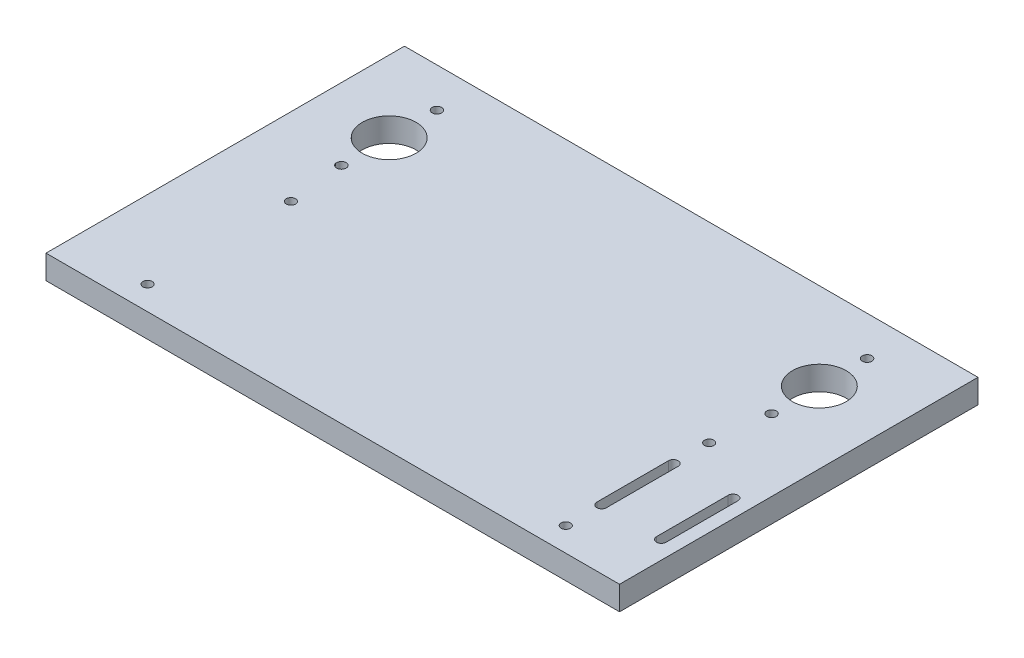
ISO-10303-21;
HEADER;
FILE_DESCRIPTION(('STEP AP214'),'2;1');
FILE_NAME('part.step','',(''),(''),'','','');
FILE_SCHEMA(('AUTOMOTIVE_DESIGN { 1 0 10303 214 1 1 1 1 }'));
ENDSEC;
DATA;
#1=APPLICATION_CONTEXT('core data for automotive mechanical design processes');
#2=APPLICATION_PROTOCOL_DEFINITION('international standard','automotive_design',2000,#1);
#3=PRODUCT_CONTEXT('',#1,'mechanical');
#4=PRODUCT('Part','Part','',(#3));
#5=PRODUCT_RELATED_PRODUCT_CATEGORY('part','',(#4));
#6=PRODUCT_DEFINITION_FORMATION('','',#4);
#7=PRODUCT_DEFINITION_CONTEXT('part definition',#1,'design');
#8=PRODUCT_DEFINITION('design','',#6,#7);
#9=PRODUCT_DEFINITION_SHAPE('','',#8);
#10=(LENGTH_UNIT() NAMED_UNIT(*) SI_UNIT(.MILLI.,.METRE.));
#11=(NAMED_UNIT(*) PLANE_ANGLE_UNIT() SI_UNIT($,.RADIAN.));
#12=(NAMED_UNIT(*) SI_UNIT($,.STERADIAN.) SOLID_ANGLE_UNIT());
#13=UNCERTAINTY_MEASURE_WITH_UNIT(LENGTH_MEASURE(1.E-05),#10,'distance_accuracy_value','');
#14=(GEOMETRIC_REPRESENTATION_CONTEXT(3) GLOBAL_UNCERTAINTY_ASSIGNED_CONTEXT((#13)) GLOBAL_UNIT_ASSIGNED_CONTEXT((#10,
#11,#12)) REPRESENTATION_CONTEXT('',''));
#15=CARTESIAN_POINT('',(0.,0.,0.));
#16=DIRECTION('',(0.,0.,1.));
#17=DIRECTION('',(1.,0.,0.));
#18=AXIS2_PLACEMENT_3D('',#15,#16,#17);
#19=CARTESIAN_POINT('',(-152.4,12.7,0.));
#20=DIRECTION('',(1.,0.,0.));
#21=DIRECTION('',(0.,0.,-1.));
#22=AXIS2_PLACEMENT_3D('',#19,#20,#21);
#23=PLANE('',#22);
#24=DIRECTION('',(0.,0.,1.));
#25=VECTOR('',#24,1.);
#26=CARTESIAN_POINT('',(-152.4,0.,0.));
#27=LINE('',#26,#25);
#28=CARTESIAN_POINT('',(-152.4,0.,-133.35));
#29=VERTEX_POINT('',#28);
#30=CARTESIAN_POINT('',(-152.4,0.,57.15));
#31=VERTEX_POINT('',#30);
#32=EDGE_CURVE('E243',#29,#31,#27,.T.);
#33=ORIENTED_EDGE('',*,*,#32,.T.);
#34=DIRECTION('',(0.,-1.,0.));
#35=VECTOR('',#34,1.);
#36=CARTESIAN_POINT('',(-152.4,12.7,57.15));
#37=LINE('',#36,#35);
#38=CARTESIAN_POINT('',(-152.4,12.7,57.15));
#39=VERTEX_POINT('',#38);
#40=EDGE_CURVE('E11',#39,#31,#37,.T.);
#41=ORIENTED_EDGE('',*,*,#40,.F.);
#42=DIRECTION('',(0.,0.,1.));
#43=VECTOR('',#42,1.);
#44=CARTESIAN_POINT('',(-152.4,12.7,0.));
#45=LINE('',#44,#43);
#46=CARTESIAN_POINT('',(-152.4,12.7,-133.35));
#47=VERTEX_POINT('',#46);
#48=EDGE_CURVE('E214',#47,#39,#45,.T.);
#49=ORIENTED_EDGE('',*,*,#48,.F.);
#50=DIRECTION('',(0.,-1.,0.));
#51=VECTOR('',#50,1.);
#52=CARTESIAN_POINT('',(-152.4,12.7,-133.35));
#53=LINE('',#52,#51);
#54=EDGE_CURVE('E228',#47,#29,#53,.T.);
#55=ORIENTED_EDGE('',*,*,#54,.T.);
#56=EDGE_LOOP('',(#33,#41,#49,#55));
#57=FACE_BOUND('',#56,.T.);
#58=ADVANCED_FACE('F35',(#57),#23,.F.);
#59=CARTESIAN_POINT('',(0.,12.7,57.15));
#60=DIRECTION('',(0.,0.,-1.));
#61=DIRECTION('',(-1.,0.,0.));
#62=AXIS2_PLACEMENT_3D('',#59,#60,#61);
#63=PLANE('',#62);
#64=DIRECTION('',(1.,0.,0.));
#65=VECTOR('',#64,1.);
#66=CARTESIAN_POINT('',(0.,0.,57.15));
#67=LINE('',#66,#65);
#68=CARTESIAN_POINT('',(152.4,0.,57.15));
#69=VERTEX_POINT('',#68);
#70=EDGE_CURVE('E246',#31,#69,#67,.T.);
#71=ORIENTED_EDGE('',*,*,#70,.T.);
#72=DIRECTION('',(0.,-1.,0.));
#73=VECTOR('',#72,1.);
#74=CARTESIAN_POINT('',(152.4,12.7,57.15));
#75=LINE('',#74,#73);
#76=CARTESIAN_POINT('',(152.4,12.7,57.15));
#77=VERTEX_POINT('',#76);
#78=EDGE_CURVE('E43',#77,#69,#75,.T.);
#79=ORIENTED_EDGE('',*,*,#78,.F.);
#80=DIRECTION('',(1.,0.,0.));
#81=VECTOR('',#80,1.);
#82=CARTESIAN_POINT('',(0.,12.7,57.15));
#83=LINE('',#82,#81);
#84=EDGE_CURVE('E217',#39,#77,#83,.T.);
#85=ORIENTED_EDGE('',*,*,#84,.F.);
#86=ORIENTED_EDGE('',*,*,#40,.T.);
#87=EDGE_LOOP('',(#71,#79,#85,#86));
#88=FACE_BOUND('',#87,.T.);
#89=ADVANCED_FACE('F265',(#88),#63,.F.);
#90=CARTESIAN_POINT('',(152.4,12.7,0.));
#91=DIRECTION('',(1.,0.,0.));
#92=DIRECTION('',(0.,0.,-1.));
#93=AXIS2_PLACEMENT_3D('',#90,#91,#92);
#94=PLANE('',#93);
#95=DIRECTION('',(0.,0.,1.));
#96=VECTOR('',#95,1.);
#97=CARTESIAN_POINT('',(152.4,0.,0.));
#98=LINE('',#97,#96);
#99=CARTESIAN_POINT('',(152.4,0.,-133.35));
#100=VERTEX_POINT('',#99);
#101=EDGE_CURVE('E249',#100,#69,#98,.T.);
#102=ORIENTED_EDGE('',*,*,#101,.F.);
#103=DIRECTION('',(0.,-1.,0.));
#104=VECTOR('',#103,1.);
#105=CARTESIAN_POINT('',(152.4,12.7,-133.35));
#106=LINE('',#105,#104);
#107=CARTESIAN_POINT('',(152.4,12.7,-133.35));
#108=VERTEX_POINT('',#107);
#109=EDGE_CURVE('E258',#108,#100,#106,.T.);
#110=ORIENTED_EDGE('',*,*,#109,.F.);
#111=DIRECTION('',(0.,0.,1.));
#112=VECTOR('',#111,1.);
#113=CARTESIAN_POINT('',(152.4,12.7,0.));
#114=LINE('',#113,#112);
#115=EDGE_CURVE('E219',#108,#77,#114,.T.);
#116=ORIENTED_EDGE('',*,*,#115,.T.);
#117=ORIENTED_EDGE('',*,*,#78,.T.);
#118=EDGE_LOOP('',(#102,#110,#116,#117));
#119=FACE_BOUND('',#118,.T.);
#120=ADVANCED_FACE('F262',(#119),#94,.T.);
#121=CARTESIAN_POINT('',(0.,12.7,-133.35));
#122=DIRECTION('',(0.,0.,-1.));
#123=DIRECTION('',(-1.,0.,0.));
#124=AXIS2_PLACEMENT_3D('',#121,#122,#123);
#125=PLANE('',#124);
#126=DIRECTION('',(1.,0.,0.));
#127=VECTOR('',#126,1.);
#128=CARTESIAN_POINT('',(0.,0.,-133.35));
#129=LINE('',#128,#127);
#130=EDGE_CURVE('E252',#29,#100,#129,.T.);
#131=ORIENTED_EDGE('',*,*,#130,.F.);
#132=ORIENTED_EDGE('',*,*,#54,.F.);
#133=DIRECTION('',(1.,0.,0.));
#134=VECTOR('',#133,1.);
#135=CARTESIAN_POINT('',(0.,12.7,-133.35));
#136=LINE('',#135,#134);
#137=EDGE_CURVE('E222',#47,#108,#136,.T.);
#138=ORIENTED_EDGE('',*,*,#137,.T.);
#139=ORIENTED_EDGE('',*,*,#109,.T.);
#140=EDGE_LOOP('',(#131,#132,#138,#139));
#141=FACE_BOUND('',#140,.T.);
#142=ADVANCED_FACE('F272',(#141),#125,.T.);
#143=CARTESIAN_POINT('',(-114.3,12.7,-87.122));
#144=DIRECTION('',(0.,-1.,0.));
#145=DIRECTION('',(0.,0.,-1.));
#146=AXIS2_PLACEMENT_3D('',#143,#144,#145);
#147=CYLINDRICAL_SURFACE('',#146,14.2748);
#148=CARTESIAN_POINT('',(-114.3,12.7,-87.122));
#149=DIRECTION('',(0.,1.,0.));
#150=DIRECTION('',(0.,0.,1.));
#151=AXIS2_PLACEMENT_3D('',#148,#149,#150);
#152=CIRCLE('',#151,14.2748);
#153=CARTESIAN_POINT('',(-114.3,12.7,-72.8472));
#154=VERTEX_POINT('',#153);
#155=EDGE_CURVE('E211',#154,#154,#152,.T.);
#156=ORIENTED_EDGE('',*,*,#155,.T.);
#157=EDGE_LOOP('',(#156));
#158=FACE_BOUND('',#157,.T.);
#159=CARTESIAN_POINT('',(-114.3,0.,-87.122));
#160=DIRECTION('',(0.,1.,0.));
#161=DIRECTION('',(0.,0.,1.));
#162=AXIS2_PLACEMENT_3D('',#159,#160,#161);
#163=CIRCLE('',#162,14.2748);
#164=CARTESIAN_POINT('',(-114.3,0.,-72.8472));
#165=VERTEX_POINT('',#164);
#166=EDGE_CURVE('E240',#165,#165,#163,.T.);
#167=ORIENTED_EDGE('',*,*,#166,.F.);
#168=EDGE_LOOP('',(#167));
#169=FACE_BOUND('',#168,.T.);
#170=ADVANCED_FACE('F287',(#158,#169),#147,.F.);
#171=CARTESIAN_POINT('',(114.3,12.7,-87.122));
#172=DIRECTION('',(0.,-1.,0.));
#173=DIRECTION('',(0.,0.,-1.));
#174=AXIS2_PLACEMENT_3D('',#171,#172,#173);
#175=CYLINDRICAL_SURFACE('',#174,14.2748);
#176=CARTESIAN_POINT('',(114.3,12.7,-87.122));
#177=DIRECTION('',(0.,1.,0.));
#178=DIRECTION('',(0.,0.,1.));
#179=AXIS2_PLACEMENT_3D('',#176,#177,#178);
#180=CIRCLE('',#179,14.2748);
#181=CARTESIAN_POINT('',(114.3,12.7,-72.8472));
#182=VERTEX_POINT('',#181);
#183=EDGE_CURVE('E208',#182,#182,#180,.T.);
#184=ORIENTED_EDGE('',*,*,#183,.T.);
#185=EDGE_LOOP('',(#184));
#186=FACE_BOUND('',#185,.T.);
#187=CARTESIAN_POINT('',(114.3,0.,-87.122));
#188=DIRECTION('',(0.,1.,0.));
#189=DIRECTION('',(0.,0.,1.));
#190=AXIS2_PLACEMENT_3D('',#187,#188,#189);
#191=CIRCLE('',#190,14.2748);
#192=CARTESIAN_POINT('',(114.3,0.,-72.8472));
#193=VERTEX_POINT('',#192);
#194=EDGE_CURVE('E237',#193,#193,#191,.T.);
#195=ORIENTED_EDGE('',*,*,#194,.F.);
#196=EDGE_LOOP('',(#195));
#197=FACE_BOUND('',#196,.T.);
#198=ADVANCED_FACE('F290',(#186,#197),#175,.F.);
#199=CARTESIAN_POINT('',(-114.3,12.7,-112.522));
#200=DIRECTION('',(0.,-1.,0.));
#201=DIRECTION('',(0.,0.,-1.));
#202=AXIS2_PLACEMENT_3D('',#199,#200,#201);
#203=CYLINDRICAL_SURFACE('',#202,2.53999999999999);
#204=CARTESIAN_POINT('',(-114.3,12.7,-112.522));
#205=DIRECTION('',(0.,1.,0.));
#206=DIRECTION('',(0.,0.,1.));
#207=AXIS2_PLACEMENT_3D('',#204,#205,#206);
#208=CIRCLE('',#207,2.53999999999999);
#209=CARTESIAN_POINT('',(-114.3,12.7,-109.982));
#210=VERTEX_POINT('',#209);
#211=EDGE_CURVE('E205',#210,#210,#208,.T.);
#212=ORIENTED_EDGE('',*,*,#211,.T.);
#213=EDGE_LOOP('',(#212));
#214=FACE_BOUND('',#213,.T.);
#215=CARTESIAN_POINT('',(-114.3,0.,-112.522));
#216=DIRECTION('',(0.,1.,0.));
#217=DIRECTION('',(0.,0.,1.));
#218=AXIS2_PLACEMENT_3D('',#215,#216,#217);
#219=CIRCLE('',#218,2.53999999999999);
#220=CARTESIAN_POINT('',(-114.3,0.,-109.982));
#221=VERTEX_POINT('',#220);
#222=EDGE_CURVE('E234',#221,#221,#219,.T.);
#223=ORIENTED_EDGE('',*,*,#222,.F.);
#224=EDGE_LOOP('',(#223));
#225=FACE_BOUND('',#224,.T.);
#226=ADVANCED_FACE('F294',(#214,#225),#203,.F.);
#227=CARTESIAN_POINT('',(-114.3,12.7,-61.7219999999999));
#228=DIRECTION('',(0.,-1.,0.));
#229=DIRECTION('',(0.,0.,-1.));
#230=AXIS2_PLACEMENT_3D('',#227,#228,#229);
#231=CYLINDRICAL_SURFACE('',#230,2.54);
#232=CARTESIAN_POINT('',(-114.3,12.7,-61.7219999999999));
#233=DIRECTION('',(0.,1.,0.));
#234=DIRECTION('',(0.,0.,1.));
#235=AXIS2_PLACEMENT_3D('',#232,#233,#234);
#236=CIRCLE('',#235,2.54);
#237=CARTESIAN_POINT('',(-114.3,12.7,-59.182));
#238=VERTEX_POINT('',#237);
#239=EDGE_CURVE('E201',#238,#238,#236,.T.);
#240=ORIENTED_EDGE('',*,*,#239,.T.);
#241=EDGE_LOOP('',(#240));
#242=FACE_BOUND('',#241,.T.);
#243=CARTESIAN_POINT('',(-114.3,0.,-61.7219999999999));
#244=DIRECTION('',(0.,1.,0.));
#245=DIRECTION('',(0.,0.,1.));
#246=AXIS2_PLACEMENT_3D('',#243,#244,#245);
#247=CIRCLE('',#246,2.54);
#248=CARTESIAN_POINT('',(-114.3,0.,-59.182));
#249=VERTEX_POINT('',#248);
#250=EDGE_CURVE('E231',#249,#249,#247,.T.);
#251=ORIENTED_EDGE('',*,*,#250,.F.);
#252=EDGE_LOOP('',(#251));
#253=FACE_BOUND('',#252,.T.);
#254=ADVANCED_FACE('F297',(#242,#253),#231,.F.);
#255=CARTESIAN_POINT('',(114.3,12.7,-112.522));
#256=DIRECTION('',(0.,-1.,0.));
#257=DIRECTION('',(0.,0.,-1.));
#258=AXIS2_PLACEMENT_3D('',#255,#256,#257);
#259=CYLINDRICAL_SURFACE('',#258,2.53999999999999);
#260=CARTESIAN_POINT('',(114.3,12.7,-112.522));
#261=DIRECTION('',(0.,1.,0.));
#262=DIRECTION('',(0.,0.,1.));
#263=AXIS2_PLACEMENT_3D('',#260,#261,#262);
#264=CIRCLE('',#263,2.53999999999999);
#265=CARTESIAN_POINT('',(114.3,12.7,-109.982));
#266=VERTEX_POINT('',#265);
#267=EDGE_CURVE('E198',#266,#266,#264,.F.);
#268=ORIENTED_EDGE('',*,*,#267,.F.);
#269=EDGE_LOOP('',(#268));
#270=FACE_BOUND('',#269,.T.);
#271=CARTESIAN_POINT('',(114.3,0.,-112.522));
#272=DIRECTION('',(0.,1.,0.));
#273=DIRECTION('',(0.,0.,1.));
#274=AXIS2_PLACEMENT_3D('',#271,#272,#273);
#275=CIRCLE('',#274,2.53999999999999);
#276=CARTESIAN_POINT('',(114.3,0.,-109.982));
#277=VERTEX_POINT('',#276);
#278=EDGE_CURVE('E164',#277,#277,#275,.F.);
#279=ORIENTED_EDGE('',*,*,#278,.T.);
#280=EDGE_LOOP('',(#279));
#281=FACE_BOUND('',#280,.T.);
#282=ADVANCED_FACE('F37',(#270,#281),#259,.F.);
#283=CARTESIAN_POINT('',(114.3,12.7,-61.722));
#284=DIRECTION('',(0.,-1.,0.));
#285=DIRECTION('',(0.,0.,-1.));
#286=AXIS2_PLACEMENT_3D('',#283,#284,#285);
#287=CYLINDRICAL_SURFACE('',#286,2.54);
#288=CARTESIAN_POINT('',(114.3,12.7,-61.722));
#289=DIRECTION('',(0.,1.,0.));
#290=DIRECTION('',(0.,0.,1.));
#291=AXIS2_PLACEMENT_3D('',#288,#289,#290);
#292=CIRCLE('',#291,2.54);
#293=CARTESIAN_POINT('',(114.3,12.7,-59.182));
#294=VERTEX_POINT('',#293);
#295=EDGE_CURVE('E225',#294,#294,#292,.F.);
#296=ORIENTED_EDGE('',*,*,#295,.F.);
#297=EDGE_LOOP('',(#296));
#298=FACE_BOUND('',#297,.T.);
#299=CARTESIAN_POINT('',(114.3,0.,-61.722));
#300=DIRECTION('',(0.,1.,0.));
#301=DIRECTION('',(0.,0.,1.));
#302=AXIS2_PLACEMENT_3D('',#299,#300,#301);
#303=CIRCLE('',#302,2.54);
#304=CARTESIAN_POINT('',(114.3,0.,-59.182));
#305=VERTEX_POINT('',#304);
#306=EDGE_CURVE('E202',#305,#305,#303,.F.);
#307=ORIENTED_EDGE('',*,*,#306,.T.);
#308=EDGE_LOOP('',(#307));
#309=FACE_BOUND('',#308,.T.);
#310=ADVANCED_FACE('F304',(#298,#309),#287,.F.);
#311=CARTESIAN_POINT('',(0.,12.7,0.));
#312=DIRECTION('',(0.,1.,0.));
#313=DIRECTION('',(0.,0.,1.));
#314=AXIS2_PLACEMENT_3D('',#311,#312,#313);
#315=PLANE('',#314);
#316=CARTESIAN_POINT('',(-111.125,12.7,44.4499999999996));
#317=DIRECTION('',(0.,-1.,0.));
#318=DIRECTION('',(0.,0.,-1.));
#319=AXIS2_PLACEMENT_3D('',#316,#317,#318);
#320=CIRCLE('',#319,2.4765);
#321=CARTESIAN_POINT('',(-111.125,12.7,41.9734999999996));
#322=VERTEX_POINT('',#321);
#323=EDGE_CURVE('E503',#322,#322,#320,.T.);
#324=ORIENTED_EDGE('',*,*,#323,.T.);
#325=EDGE_LOOP('',(#324));
#326=FACE_BOUND('',#325,.T.);
#327=CARTESIAN_POINT('',(-111.125,12.7,-31.7500000000004));
#328=DIRECTION('',(0.,-1.,0.));
#329=DIRECTION('',(0.,0.,-1.));
#330=AXIS2_PLACEMENT_3D('',#327,#328,#329);
#331=CIRCLE('',#330,2.4765);
#332=CARTESIAN_POINT('',(-111.125,12.7,-34.2265000000004));
#333=VERTEX_POINT('',#332);
#334=EDGE_CURVE('E523',#333,#333,#331,.T.);
#335=ORIENTED_EDGE('',*,*,#334,.T.);
#336=EDGE_LOOP('',(#335));
#337=FACE_BOUND('',#336,.T.);
#338=CARTESIAN_POINT('',(111.125,12.7,-31.7500000000003));
#339=DIRECTION('',(0.,-1.,0.));
#340=DIRECTION('',(0.,0.,-1.));
#341=AXIS2_PLACEMENT_3D('',#338,#339,#340);
#342=CIRCLE('',#341,2.4765);
#343=CARTESIAN_POINT('',(111.125,12.7,-34.2265000000003));
#344=VERTEX_POINT('',#343);
#345=EDGE_CURVE('E514',#344,#344,#342,.T.);
#346=ORIENTED_EDGE('',*,*,#345,.T.);
#347=EDGE_LOOP('',(#346));
#348=FACE_BOUND('',#347,.T.);
#349=CARTESIAN_POINT('',(111.125,12.7,44.4499999999998));
#350=DIRECTION('',(0.,-1.,0.));
#351=DIRECTION('',(0.,0.,-1.));
#352=AXIS2_PLACEMENT_3D('',#349,#350,#351);
#353=CIRCLE('',#352,2.4765);
#354=CARTESIAN_POINT('',(111.125,12.7,41.9734999999998));
#355=VERTEX_POINT('',#354);
#356=EDGE_CURVE('E184',#355,#355,#353,.T.);
#357=ORIENTED_EDGE('',*,*,#356,.T.);
#358=EDGE_LOOP('',(#357));
#359=FACE_BOUND('',#358,.T.);
#360=CARTESIAN_POINT('',(111.125,12.7,25.4));
#361=DIRECTION('',(0.,1.,0.));
#362=DIRECTION('',(0.,0.,1.));
#363=AXIS2_PLACEMENT_3D('',#360,#361,#362);
#364=CIRCLE('',#363,2.5796875);
#365=CARTESIAN_POINT('',(108.5453125,12.7,25.4));
#366=VERTEX_POINT('',#365);
#367=CARTESIAN_POINT('',(113.7046875,12.7,25.4));
#368=VERTEX_POINT('',#367);
#369=EDGE_CURVE('E50',#366,#368,#364,.T.);
#370=ORIENTED_EDGE('',*,*,#369,.F.);
#371=DIRECTION('',(0.,0.,1.));
#372=VECTOR('',#371,1.);
#373=CARTESIAN_POINT('',(108.5453125,12.7,25.4));
#374=LINE('',#373,#372);
#375=CARTESIAN_POINT('',(108.5453125,12.7,-12.7));
#376=VERTEX_POINT('',#375);
#377=EDGE_CURVE('E145',#376,#366,#374,.T.);
#378=ORIENTED_EDGE('',*,*,#377,.F.);
#379=CARTESIAN_POINT('',(111.125,12.7,-12.7));
#380=DIRECTION('',(0.,1.,0.));
#381=DIRECTION('',(0.,0.,1.));
#382=AXIS2_PLACEMENT_3D('',#379,#380,#381);
#383=CIRCLE('',#382,2.5796875);
#384=CARTESIAN_POINT('',(113.7046875,12.7,-12.7));
#385=VERTEX_POINT('',#384);
#386=EDGE_CURVE('E148',#385,#376,#383,.T.);
#387=ORIENTED_EDGE('',*,*,#386,.F.);
#388=DIRECTION('',(0.,0.,-1.));
#389=VECTOR('',#388,1.);
#390=CARTESIAN_POINT('',(113.7046875,12.7,25.4));
#391=LINE('',#390,#389);
#392=EDGE_CURVE('E157',#368,#385,#391,.T.);
#393=ORIENTED_EDGE('',*,*,#392,.F.);
#394=EDGE_LOOP('',(#370,#378,#387,#393));
#395=FACE_BOUND('',#394,.T.);
#396=CARTESIAN_POINT('',(142.875,12.7,25.4));
#397=DIRECTION('',(0.,1.,0.));
#398=DIRECTION('',(0.,0.,1.));
#399=AXIS2_PLACEMENT_3D('',#396,#397,#398);
#400=CIRCLE('',#399,2.57968750000001);
#401=CARTESIAN_POINT('',(140.2953125,12.7,25.4));
#402=VERTEX_POINT('',#401);
#403=CARTESIAN_POINT('',(145.4546875,12.7,25.4));
#404=VERTEX_POINT('',#403);
#405=EDGE_CURVE('E58',#402,#404,#400,.T.);
#406=ORIENTED_EDGE('',*,*,#405,.F.);
#407=DIRECTION('',(0.,0.,1.));
#408=VECTOR('',#407,1.);
#409=CARTESIAN_POINT('',(140.2953125,12.7,25.4));
#410=LINE('',#409,#408);
#411=CARTESIAN_POINT('',(140.2953125,12.7,-12.7));
#412=VERTEX_POINT('',#411);
#413=EDGE_CURVE('E172',#412,#402,#410,.T.);
#414=ORIENTED_EDGE('',*,*,#413,.F.);
#415=CARTESIAN_POINT('',(142.875,12.7,-12.7));
#416=DIRECTION('',(0.,1.,0.));
#417=DIRECTION('',(0.,0.,1.));
#418=AXIS2_PLACEMENT_3D('',#415,#416,#417);
#419=CIRCLE('',#418,2.57968750000001);
#420=CARTESIAN_POINT('',(145.4546875,12.7,-12.7));
#421=VERTEX_POINT('',#420);
#422=EDGE_CURVE('E187',#421,#412,#419,.T.);
#423=ORIENTED_EDGE('',*,*,#422,.F.);
#424=DIRECTION('',(0.,0.,-1.));
#425=VECTOR('',#424,1.);
#426=CARTESIAN_POINT('',(145.4546875,12.7,25.4));
#427=LINE('',#426,#425);
#428=EDGE_CURVE('E183',#404,#421,#427,.T.);
#429=ORIENTED_EDGE('',*,*,#428,.F.);
#430=EDGE_LOOP('',(#406,#414,#423,#429));
#431=FACE_BOUND('',#430,.T.);
#432=ORIENTED_EDGE('',*,*,#267,.T.);
#433=EDGE_LOOP('',(#432));
#434=FACE_BOUND('',#433,.T.);
#435=ORIENTED_EDGE('',*,*,#239,.F.);
#436=EDGE_LOOP('',(#435));
#437=FACE_BOUND('',#436,.T.);
#438=ORIENTED_EDGE('',*,*,#211,.F.);
#439=EDGE_LOOP('',(#438));
#440=FACE_BOUND('',#439,.T.);
#441=ORIENTED_EDGE('',*,*,#183,.F.);
#442=EDGE_LOOP('',(#441));
#443=FACE_BOUND('',#442,.T.);
#444=ORIENTED_EDGE('',*,*,#155,.F.);
#445=EDGE_LOOP('',(#444));
#446=FACE_BOUND('',#445,.T.);
#447=ORIENTED_EDGE('',*,*,#48,.T.);
#448=ORIENTED_EDGE('',*,*,#84,.T.);
#449=ORIENTED_EDGE('',*,*,#115,.F.);
#450=ORIENTED_EDGE('',*,*,#137,.F.);
#451=EDGE_LOOP('',(#447,#448,#449,#450));
#452=FACE_BOUND('',#451,.T.);
#453=ORIENTED_EDGE('',*,*,#295,.T.);
#454=EDGE_LOOP('',(#453));
#455=FACE_BOUND('',#454,.T.);
#456=ADVANCED_FACE('F276',(#326,#337,#348,#359,#395,#431,#434,#437,#440,#443,#446,#452,#455),
#315,.T.);
#457=CARTESIAN_POINT('',(0.,0.,0.));
#458=DIRECTION('',(0.,1.,0.));
#459=DIRECTION('',(0.,0.,1.));
#460=AXIS2_PLACEMENT_3D('',#457,#458,#459);
#461=PLANE('',#460);
#462=CARTESIAN_POINT('',(-111.125,0.,44.4499999999996));
#463=DIRECTION('',(0.,-1.,0.));
#464=DIRECTION('',(0.,0.,-1.));
#465=AXIS2_PLACEMENT_3D('',#462,#463,#464);
#466=CIRCLE('',#465,2.4765);
#467=CARTESIAN_POINT('',(-111.125,0.,41.9734999999996));
#468=VERTEX_POINT('',#467);
#469=EDGE_CURVE('E505',#468,#468,#466,.T.);
#470=ORIENTED_EDGE('',*,*,#469,.F.);
#471=EDGE_LOOP('',(#470));
#472=FACE_BOUND('',#471,.T.);
#473=CARTESIAN_POINT('',(-111.125,0.,-31.7500000000004));
#474=DIRECTION('',(0.,-1.,0.));
#475=DIRECTION('',(0.,0.,-1.));
#476=AXIS2_PLACEMENT_3D('',#473,#474,#475);
#477=CIRCLE('',#476,2.4765);
#478=CARTESIAN_POINT('',(-111.125,0.,-34.2265000000004));
#479=VERTEX_POINT('',#478);
#480=EDGE_CURVE('E507',#479,#479,#477,.T.);
#481=ORIENTED_EDGE('',*,*,#480,.F.);
#482=EDGE_LOOP('',(#481));
#483=FACE_BOUND('',#482,.T.);
#484=CARTESIAN_POINT('',(111.125,0.,-31.7500000000003));
#485=DIRECTION('',(0.,-1.,0.));
#486=DIRECTION('',(0.,0.,-1.));
#487=AXIS2_PLACEMENT_3D('',#484,#485,#486);
#488=CIRCLE('',#487,2.4765);
#489=CARTESIAN_POINT('',(111.125,0.,-34.2265000000003));
#490=VERTEX_POINT('',#489);
#491=EDGE_CURVE('E518',#490,#490,#488,.T.);
#492=ORIENTED_EDGE('',*,*,#491,.F.);
#493=EDGE_LOOP('',(#492));
#494=FACE_BOUND('',#493,.T.);
#495=CARTESIAN_POINT('',(111.125,0.,44.4499999999998));
#496=DIRECTION('',(0.,-1.,0.));
#497=DIRECTION('',(0.,0.,-1.));
#498=AXIS2_PLACEMENT_3D('',#495,#496,#497);
#499=CIRCLE('',#498,2.4765);
#500=CARTESIAN_POINT('',(111.125,0.,41.9734999999998));
#501=VERTEX_POINT('',#500);
#502=EDGE_CURVE('E151',#501,#501,#499,.T.);
#503=ORIENTED_EDGE('',*,*,#502,.F.);
#504=EDGE_LOOP('',(#503));
#505=FACE_BOUND('',#504,.T.);
#506=DIRECTION('',(0.,0.,1.));
#507=VECTOR('',#506,1.);
#508=CARTESIAN_POINT('',(108.5453125,0.,25.4));
#509=LINE('',#508,#507);
#510=CARTESIAN_POINT('',(108.5453125,0.,-12.7));
#511=VERTEX_POINT('',#510);
#512=CARTESIAN_POINT('',(108.5453125,0.,25.4));
#513=VERTEX_POINT('',#512);
#514=EDGE_CURVE('E132',#511,#513,#509,.T.);
#515=ORIENTED_EDGE('',*,*,#514,.T.);
#516=CARTESIAN_POINT('',(111.125,0.,25.4));
#517=DIRECTION('',(0.,1.,0.));
#518=DIRECTION('',(0.,0.,1.));
#519=AXIS2_PLACEMENT_3D('',#516,#517,#518);
#520=CIRCLE('',#519,2.5796875);
#521=CARTESIAN_POINT('',(113.7046875,0.,25.4));
#522=VERTEX_POINT('',#521);
#523=EDGE_CURVE('E126',#513,#522,#520,.T.);
#524=ORIENTED_EDGE('',*,*,#523,.T.);
#525=DIRECTION('',(0.,0.,-1.));
#526=VECTOR('',#525,1.);
#527=CARTESIAN_POINT('',(113.7046875,0.,25.4));
#528=LINE('',#527,#526);
#529=CARTESIAN_POINT('',(113.7046875,0.,-12.7));
#530=VERTEX_POINT('',#529);
#531=EDGE_CURVE('E136',#522,#530,#528,.T.);
#532=ORIENTED_EDGE('',*,*,#531,.T.);
#533=CARTESIAN_POINT('',(111.125,0.,-12.7));
#534=DIRECTION('',(0.,1.,0.));
#535=DIRECTION('',(0.,0.,1.));
#536=AXIS2_PLACEMENT_3D('',#533,#534,#535);
#537=CIRCLE('',#536,2.5796875);
#538=EDGE_CURVE('E140',#530,#511,#537,.T.);
#539=ORIENTED_EDGE('',*,*,#538,.T.);
#540=EDGE_LOOP('',(#515,#524,#532,#539));
#541=FACE_BOUND('',#540,.T.);
#542=DIRECTION('',(0.,0.,1.));
#543=VECTOR('',#542,1.);
#544=CARTESIAN_POINT('',(140.2953125,0.,25.4));
#545=LINE('',#544,#543);
#546=CARTESIAN_POINT('',(140.2953125,0.,-12.7));
#547=VERTEX_POINT('',#546);
#548=CARTESIAN_POINT('',(140.2953125,0.,25.4));
#549=VERTEX_POINT('',#548);
#550=EDGE_CURVE('E178',#547,#549,#545,.T.);
#551=ORIENTED_EDGE('',*,*,#550,.T.);
#552=CARTESIAN_POINT('',(142.875,0.,25.4));
#553=DIRECTION('',(0.,1.,0.));
#554=DIRECTION('',(0.,0.,1.));
#555=AXIS2_PLACEMENT_3D('',#552,#553,#554);
#556=CIRCLE('',#555,2.57968750000001);
#557=CARTESIAN_POINT('',(145.4546875,0.,25.4));
#558=VERTEX_POINT('',#557);
#559=EDGE_CURVE('E168',#549,#558,#556,.T.);
#560=ORIENTED_EDGE('',*,*,#559,.T.);
#561=DIRECTION('',(0.,0.,-1.));
#562=VECTOR('',#561,1.);
#563=CARTESIAN_POINT('',(145.4546875,0.,25.4));
#564=LINE('',#563,#562);
#565=CARTESIAN_POINT('',(145.4546875,0.,-12.7));
#566=VERTEX_POINT('',#565);
#567=EDGE_CURVE('E171',#558,#566,#564,.T.);
#568=ORIENTED_EDGE('',*,*,#567,.T.);
#569=CARTESIAN_POINT('',(142.875,0.,-12.7));
#570=DIRECTION('',(0.,1.,0.));
#571=DIRECTION('',(0.,0.,1.));
#572=AXIS2_PLACEMENT_3D('',#569,#570,#571);
#573=CIRCLE('',#572,2.57968750000001);
#574=EDGE_CURVE('E175',#566,#547,#573,.T.);
#575=ORIENTED_EDGE('',*,*,#574,.T.);
#576=EDGE_LOOP('',(#551,#560,#568,#575));
#577=FACE_BOUND('',#576,.T.);
#578=ORIENTED_EDGE('',*,*,#278,.F.);
#579=EDGE_LOOP('',(#578));
#580=FACE_BOUND('',#579,.T.);
#581=ORIENTED_EDGE('',*,*,#250,.T.);
#582=EDGE_LOOP('',(#581));
#583=FACE_BOUND('',#582,.T.);
#584=ORIENTED_EDGE('',*,*,#222,.T.);
#585=EDGE_LOOP('',(#584));
#586=FACE_BOUND('',#585,.T.);
#587=ORIENTED_EDGE('',*,*,#194,.T.);
#588=EDGE_LOOP('',(#587));
#589=FACE_BOUND('',#588,.T.);
#590=ORIENTED_EDGE('',*,*,#166,.T.);
#591=EDGE_LOOP('',(#590));
#592=FACE_BOUND('',#591,.T.);
#593=ORIENTED_EDGE('',*,*,#32,.F.);
#594=ORIENTED_EDGE('',*,*,#130,.T.);
#595=ORIENTED_EDGE('',*,*,#101,.T.);
#596=ORIENTED_EDGE('',*,*,#70,.F.);
#597=EDGE_LOOP('',(#593,#594,#595,#596));
#598=FACE_BOUND('',#597,.T.);
#599=ORIENTED_EDGE('',*,*,#306,.F.);
#600=EDGE_LOOP('',(#599));
#601=FACE_BOUND('',#600,.T.);
#602=ADVANCED_FACE('F142',(#472,#483,#494,#505,#541,#577,#580,#583,#586,#589,#592,#598,#601),
#461,.F.);
#603=CARTESIAN_POINT('',(142.875,0.,25.4));
#604=DIRECTION('',(0.,1.,0.));
#605=DIRECTION('',(0.,0.,1.));
#606=AXIS2_PLACEMENT_3D('',#603,#604,#605);
#607=CYLINDRICAL_SURFACE('',#606,2.57968750000001);
#608=ORIENTED_EDGE('',*,*,#405,.T.);
#609=DIRECTION('',(0.,1.,0.));
#610=VECTOR('',#609,1.);
#611=CARTESIAN_POINT('',(145.4546875,0.,25.4));
#612=LINE('',#611,#610);
#613=EDGE_CURVE('E181',#558,#404,#612,.T.);
#614=ORIENTED_EDGE('',*,*,#613,.F.);
#615=ORIENTED_EDGE('',*,*,#559,.F.);
#616=DIRECTION('',(0.,1.,0.));
#617=VECTOR('',#616,1.);
#618=CARTESIAN_POINT('',(140.2953125,0.,25.4));
#619=LINE('',#618,#617);
#620=EDGE_CURVE('E158',#549,#402,#619,.T.);
#621=ORIENTED_EDGE('',*,*,#620,.T.);
#622=EDGE_LOOP('',(#608,#614,#615,#621));
#623=FACE_BOUND('',#622,.T.);
#624=ADVANCED_FACE('F312',(#623),#607,.F.);
#625=CARTESIAN_POINT('',(140.2953125,0.,25.4));
#626=DIRECTION('',(-1.,0.,0.));
#627=DIRECTION('',(0.,0.,1.));
#628=AXIS2_PLACEMENT_3D('',#625,#626,#627);
#629=PLANE('',#628);
#630=ORIENTED_EDGE('',*,*,#413,.T.);
#631=ORIENTED_EDGE('',*,*,#620,.F.);
#632=ORIENTED_EDGE('',*,*,#550,.F.);
#633=DIRECTION('',(0.,1.,0.));
#634=VECTOR('',#633,1.);
#635=CARTESIAN_POINT('',(140.2953125,0.,-12.7));
#636=LINE('',#635,#634);
#637=EDGE_CURVE('E193',#547,#412,#636,.T.);
#638=ORIENTED_EDGE('',*,*,#637,.T.);
#639=EDGE_LOOP('',(#630,#631,#632,#638));
#640=FACE_BOUND('',#639,.T.);
#641=ADVANCED_FACE('F327',(#640),#629,.F.);
#642=CARTESIAN_POINT('',(142.875,0.,-12.7));
#643=DIRECTION('',(0.,1.,0.));
#644=DIRECTION('',(0.,0.,1.));
#645=AXIS2_PLACEMENT_3D('',#642,#643,#644);
#646=CYLINDRICAL_SURFACE('',#645,2.57968750000001);
#647=ORIENTED_EDGE('',*,*,#422,.T.);
#648=ORIENTED_EDGE('',*,*,#637,.F.);
#649=ORIENTED_EDGE('',*,*,#574,.F.);
#650=DIRECTION('',(0.,1.,0.));
#651=VECTOR('',#650,1.);
#652=CARTESIAN_POINT('',(145.4546875,0.,-12.7));
#653=LINE('',#652,#651);
#654=EDGE_CURVE('E195',#566,#421,#653,.T.);
#655=ORIENTED_EDGE('',*,*,#654,.T.);
#656=EDGE_LOOP('',(#647,#648,#649,#655));
#657=FACE_BOUND('',#656,.T.);
#658=ADVANCED_FACE('F392',(#657),#646,.F.);
#659=CARTESIAN_POINT('',(145.4546875,0.,25.4));
#660=DIRECTION('',(1.,0.,0.));
#661=DIRECTION('',(0.,0.,-1.));
#662=AXIS2_PLACEMENT_3D('',#659,#660,#661);
#663=PLANE('',#662);
#664=ORIENTED_EDGE('',*,*,#428,.T.);
#665=ORIENTED_EDGE('',*,*,#654,.F.);
#666=ORIENTED_EDGE('',*,*,#567,.F.);
#667=ORIENTED_EDGE('',*,*,#613,.T.);
#668=EDGE_LOOP('',(#664,#665,#666,#667));
#669=FACE_BOUND('',#668,.T.);
#670=ADVANCED_FACE('F402',(#669),#663,.F.);
#671=CARTESIAN_POINT('',(111.125,0.,25.4));
#672=DIRECTION('',(0.,1.,0.));
#673=DIRECTION('',(0.,0.,1.));
#674=AXIS2_PLACEMENT_3D('',#671,#672,#673);
#675=CYLINDRICAL_SURFACE('',#674,2.5796875);
#676=ORIENTED_EDGE('',*,*,#369,.T.);
#677=DIRECTION('',(0.,1.,0.));
#678=VECTOR('',#677,1.);
#679=CARTESIAN_POINT('',(113.7046875,0.,25.4));
#680=LINE('',#679,#678);
#681=EDGE_CURVE('E122',#522,#368,#680,.T.);
#682=ORIENTED_EDGE('',*,*,#681,.F.);
#683=ORIENTED_EDGE('',*,*,#523,.F.);
#684=DIRECTION('',(0.,1.,0.));
#685=VECTOR('',#684,1.);
#686=CARTESIAN_POINT('',(108.5453125,0.,25.4));
#687=LINE('',#686,#685);
#688=EDGE_CURVE('E162',#513,#366,#687,.T.);
#689=ORIENTED_EDGE('',*,*,#688,.T.);
#690=EDGE_LOOP('',(#676,#682,#683,#689));
#691=FACE_BOUND('',#690,.T.);
#692=ADVANCED_FACE('F124',(#691),#675,.F.);
#693=CARTESIAN_POINT('',(108.5453125,0.,25.4));
#694=DIRECTION('',(-1.,0.,0.));
#695=DIRECTION('',(0.,0.,1.));
#696=AXIS2_PLACEMENT_3D('',#693,#694,#695);
#697=PLANE('',#696);
#698=ORIENTED_EDGE('',*,*,#377,.T.);
#699=ORIENTED_EDGE('',*,*,#688,.F.);
#700=ORIENTED_EDGE('',*,*,#514,.F.);
#701=DIRECTION('',(0.,1.,0.));
#702=VECTOR('',#701,1.);
#703=CARTESIAN_POINT('',(108.5453125,0.,-12.7));
#704=LINE('',#703,#702);
#705=EDGE_CURVE('E165',#511,#376,#704,.T.);
#706=ORIENTED_EDGE('',*,*,#705,.T.);
#707=EDGE_LOOP('',(#698,#699,#700,#706));
#708=FACE_BOUND('',#707,.T.);
#709=ADVANCED_FACE('F421',(#708),#697,.F.);
#710=CARTESIAN_POINT('',(111.125,0.,-12.7));
#711=DIRECTION('',(0.,1.,0.));
#712=DIRECTION('',(0.,0.,1.));
#713=AXIS2_PLACEMENT_3D('',#710,#711,#712);
#714=CYLINDRICAL_SURFACE('',#713,2.5796875);
#715=ORIENTED_EDGE('',*,*,#386,.T.);
#716=ORIENTED_EDGE('',*,*,#705,.F.);
#717=ORIENTED_EDGE('',*,*,#538,.F.);
#718=DIRECTION('',(0.,1.,0.));
#719=VECTOR('',#718,1.);
#720=CARTESIAN_POINT('',(113.7046875,0.,-12.7));
#721=LINE('',#720,#719);
#722=EDGE_CURVE('E131',#530,#385,#721,.T.);
#723=ORIENTED_EDGE('',*,*,#722,.T.);
#724=EDGE_LOOP('',(#715,#716,#717,#723));
#725=FACE_BOUND('',#724,.T.);
#726=ADVANCED_FACE('F430',(#725),#714,.F.);
#727=CARTESIAN_POINT('',(113.7046875,0.,25.4));
#728=DIRECTION('',(1.,0.,0.));
#729=DIRECTION('',(0.,0.,-1.));
#730=AXIS2_PLACEMENT_3D('',#727,#728,#729);
#731=PLANE('',#730);
#732=ORIENTED_EDGE('',*,*,#392,.T.);
#733=ORIENTED_EDGE('',*,*,#722,.F.);
#734=ORIENTED_EDGE('',*,*,#531,.F.);
#735=ORIENTED_EDGE('',*,*,#681,.T.);
#736=EDGE_LOOP('',(#732,#733,#734,#735));
#737=FACE_BOUND('',#736,.T.);
#738=ADVANCED_FACE('F137',(#737),#731,.F.);
#739=CARTESIAN_POINT('',(111.125,12.7,44.4499999999998));
#740=DIRECTION('',(0.,-1.,0.));
#741=DIRECTION('',(0.,0.,-1.));
#742=AXIS2_PLACEMENT_3D('',#739,#740,#741);
#743=CYLINDRICAL_SURFACE('',#742,2.4765);
#744=ORIENTED_EDGE('',*,*,#356,.F.);
#745=EDGE_LOOP('',(#744));
#746=FACE_BOUND('',#745,.T.);
#747=ORIENTED_EDGE('',*,*,#502,.T.);
#748=EDGE_LOOP('',(#747));
#749=FACE_BOUND('',#748,.T.);
#750=ADVANCED_FACE('F449',(#746,#749),#743,.F.);
#751=CARTESIAN_POINT('',(111.125,12.7,-31.7500000000003));
#752=DIRECTION('',(0.,-1.,0.));
#753=DIRECTION('',(0.,0.,-1.));
#754=AXIS2_PLACEMENT_3D('',#751,#752,#753);
#755=CYLINDRICAL_SURFACE('',#754,2.4765);
#756=ORIENTED_EDGE('',*,*,#345,.F.);
#757=EDGE_LOOP('',(#756));
#758=FACE_BOUND('',#757,.T.);
#759=ORIENTED_EDGE('',*,*,#491,.T.);
#760=EDGE_LOOP('',(#759));
#761=FACE_BOUND('',#760,.T.);
#762=ADVANCED_FACE('F466',(#758,#761),#755,.F.);
#763=CARTESIAN_POINT('',(-111.125,12.7,-31.7500000000004));
#764=DIRECTION('',(0.,-1.,0.));
#765=DIRECTION('',(0.,0.,-1.));
#766=AXIS2_PLACEMENT_3D('',#763,#764,#765);
#767=CYLINDRICAL_SURFACE('',#766,2.4765);
#768=ORIENTED_EDGE('',*,*,#334,.F.);
#769=EDGE_LOOP('',(#768));
#770=FACE_BOUND('',#769,.T.);
#771=ORIENTED_EDGE('',*,*,#480,.T.);
#772=EDGE_LOOP('',(#771));
#773=FACE_BOUND('',#772,.T.);
#774=ADVANCED_FACE('F476',(#770,#773),#767,.F.);
#775=CARTESIAN_POINT('',(-111.125,12.7,44.4499999999996));
#776=DIRECTION('',(0.,-1.,0.));
#777=DIRECTION('',(0.,0.,-1.));
#778=AXIS2_PLACEMENT_3D('',#775,#776,#777);
#779=CYLINDRICAL_SURFACE('',#778,2.4765);
#780=ORIENTED_EDGE('',*,*,#323,.F.);
#781=EDGE_LOOP('',(#780));
#782=FACE_BOUND('',#781,.T.);
#783=ORIENTED_EDGE('',*,*,#469,.T.);
#784=EDGE_LOOP('',(#783));
#785=FACE_BOUND('',#784,.T.);
#786=ADVANCED_FACE('F486',(#782,#785),#779,.F.);
#787=CLOSED_SHELL('',(#58,#89,#120,#142,#170,#198,#226,#254,#282,#310,#456,#602,#624,#641,#658,
#670,#692,#709,#726,#738,#750,#762,#774,#786));
#788=MANIFOLD_SOLID_BREP('B2',#787);
#789=ADVANCED_BREP_SHAPE_REPRESENTATION('',(#18,#788),#14);
#790=SHAPE_DEFINITION_REPRESENTATION(#9,#789);
ENDSEC;
END-ISO-10303-21;
